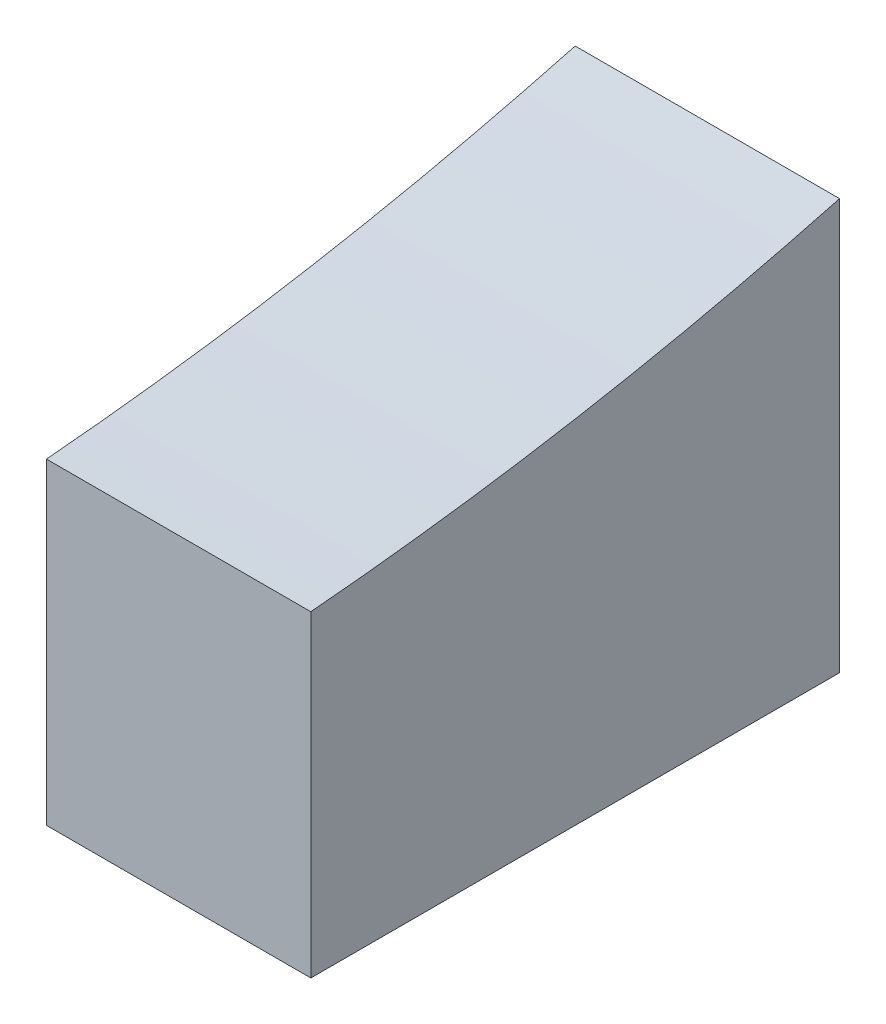
ISO-10303-21;
HEADER;
FILE_DESCRIPTION(('STEP AP214'),'2;1');
FILE_NAME('part.step','',(''),(''),'','','');
FILE_SCHEMA(('AUTOMOTIVE_DESIGN { 1 0 10303 214 1 1 1 1 }'));
ENDSEC;
DATA;
#1=APPLICATION_CONTEXT('core data for automotive mechanical design processes');
#2=APPLICATION_PROTOCOL_DEFINITION('international standard','automotive_design',2000,#1);
#3=PRODUCT_CONTEXT('',#1,'mechanical');
#4=PRODUCT('Part','Part','',(#3));
#5=PRODUCT_RELATED_PRODUCT_CATEGORY('part','',(#4));
#6=PRODUCT_DEFINITION_FORMATION('','',#4);
#7=PRODUCT_DEFINITION_CONTEXT('part definition',#1,'design');
#8=PRODUCT_DEFINITION('design','',#6,#7);
#9=PRODUCT_DEFINITION_SHAPE('','',#8);
#10=(LENGTH_UNIT() NAMED_UNIT(*) SI_UNIT(.MILLI.,.METRE.));
#11=(NAMED_UNIT(*) PLANE_ANGLE_UNIT() SI_UNIT($,.RADIAN.));
#12=(NAMED_UNIT(*) SI_UNIT($,.STERADIAN.) SOLID_ANGLE_UNIT());
#13=UNCERTAINTY_MEASURE_WITH_UNIT(LENGTH_MEASURE(1.E-05),#10,'distance_accuracy_value','');
#14=(GEOMETRIC_REPRESENTATION_CONTEXT(3) GLOBAL_UNCERTAINTY_ASSIGNED_CONTEXT((#13)) GLOBAL_UNIT_ASSIGNED_CONTEXT((#10,
#11,#12)) REPRESENTATION_CONTEXT('',''));
#15=CARTESIAN_POINT('',(0.,0.,0.));
#16=DIRECTION('',(0.,0.,1.));
#17=DIRECTION('',(1.,0.,0.));
#18=AXIS2_PLACEMENT_3D('',#15,#16,#17);
#19=CARTESIAN_POINT('',(10.,127.,0.));
#20=DIRECTION('',(-1.,0.,0.));
#21=DIRECTION('',(0.,0.,1.));
#22=AXIS2_PLACEMENT_3D('',#19,#20,#21);
#23=CYLINDRICAL_SURFACE('',#22,115.433963806152);
#24=CARTESIAN_POINT('',(0.,127.,0.));
#25=DIRECTION('',(-1.,0.,0.));
#26=DIRECTION('',(0.,0.,-1.));
#27=AXIS2_PLACEMENT_3D('',#24,#25,#26);
#28=CIRCLE('',#27,115.433963806152);
#29=CARTESIAN_POINT('',(0.,15.5325159519602,-30.));
#30=VERTEX_POINT('',#29);
#31=CARTESIAN_POINT('',(0.,12.,-10.));
#32=VERTEX_POINT('',#31);
#33=EDGE_CURVE('E98',#30,#32,#28,.T.);
#34=ORIENTED_EDGE('',*,*,#33,.T.);
#35=DIRECTION('',(-1.,0.,0.));
#36=VECTOR('',#35,1.);
#37=CARTESIAN_POINT('',(10.,12.,-10.));
#38=LINE('',#37,#36);
#39=CARTESIAN_POINT('',(10.,12.,-10.));
#40=VERTEX_POINT('',#39);
#41=EDGE_CURVE('E11',#40,#32,#38,.T.);
#42=ORIENTED_EDGE('',*,*,#41,.F.);
#43=CARTESIAN_POINT('',(10.,127.,0.));
#44=DIRECTION('',(-1.,0.,0.));
#45=DIRECTION('',(0.,0.,-1.));
#46=AXIS2_PLACEMENT_3D('',#43,#44,#45);
#47=CIRCLE('',#46,115.433963806152);
#48=CARTESIAN_POINT('',(10.,15.5325159519602,-30.));
#49=VERTEX_POINT('',#48);
#50=EDGE_CURVE('E86',#49,#40,#47,.T.);
#51=ORIENTED_EDGE('',*,*,#50,.F.);
#52=DIRECTION('',(-1.,0.,0.));
#53=VECTOR('',#52,1.);
#54=CARTESIAN_POINT('',(10.,15.5325159519602,-30.));
#55=LINE('',#54,#53);
#56=EDGE_CURVE('E94',#49,#30,#55,.T.);
#57=ORIENTED_EDGE('',*,*,#56,.T.);
#58=EDGE_LOOP('',(#34,#42,#51,#57));
#59=FACE_BOUND('',#58,.T.);
#60=ADVANCED_FACE('F35',(#59),#23,.F.);
#61=CARTESIAN_POINT('',(10.,12.,-10.));
#62=DIRECTION('',(0.,0.,-1.));
#63=DIRECTION('',(0.,1.,0.));
#64=AXIS2_PLACEMENT_3D('',#61,#62,#63);
#65=PLANE('',#64);
#66=DIRECTION('',(0.,-1.,0.));
#67=VECTOR('',#66,1.);
#68=CARTESIAN_POINT('',(0.,12.,-10.));
#69=LINE('',#68,#67);
#70=CARTESIAN_POINT('',(0.,0.,-10.));
#71=VERTEX_POINT('',#70);
#72=EDGE_CURVE('E90',#32,#71,#69,.T.);
#73=ORIENTED_EDGE('',*,*,#72,.T.);
#74=DIRECTION('',(-1.,0.,0.));
#75=VECTOR('',#74,1.);
#76=CARTESIAN_POINT('',(10.,0.,-10.));
#77=LINE('',#76,#75);
#78=CARTESIAN_POINT('',(10.,0.,-10.));
#79=VERTEX_POINT('',#78);
#80=EDGE_CURVE('E43',#79,#71,#77,.T.);
#81=ORIENTED_EDGE('',*,*,#80,.F.);
#82=DIRECTION('',(0.,-1.,0.));
#83=VECTOR('',#82,1.);
#84=CARTESIAN_POINT('',(10.,12.,-10.));
#85=LINE('',#84,#83);
#86=EDGE_CURVE('E81',#40,#79,#85,.T.);
#87=ORIENTED_EDGE('',*,*,#86,.F.);
#88=ORIENTED_EDGE('',*,*,#41,.T.);
#89=EDGE_LOOP('',(#73,#81,#87,#88));
#90=FACE_BOUND('',#89,.T.);
#91=ADVANCED_FACE('F89',(#90),#65,.F.);
#92=CARTESIAN_POINT('',(10.,0.,-10.));
#93=DIRECTION('',(0.,1.,0.));
#94=DIRECTION('',(0.,0.,1.));
#95=AXIS2_PLACEMENT_3D('',#92,#93,#94);
#96=PLANE('',#95);
#97=CARTESIAN_POINT('',(5.,0.,-18.));
#98=DIRECTION('',(0.,-1.,0.));
#99=DIRECTION('',(0.,0.,-1.));
#100=AXIS2_PLACEMENT_3D('',#97,#98,#99);
#101=CIRCLE('',#100,3.);
#102=CARTESIAN_POINT('',(5.,0.,-21.));
#103=VERTEX_POINT('',#102);
#104=EDGE_CURVE('E112',#103,#103,#101,.T.);
#105=ORIENTED_EDGE('',*,*,#104,.F.);
#106=EDGE_LOOP('',(#105));
#107=FACE_BOUND('',#106,.T.);
#108=DIRECTION('',(0.,0.,-1.));
#109=VECTOR('',#108,1.);
#110=CARTESIAN_POINT('',(0.,0.,-10.));
#111=LINE('',#110,#109);
#112=CARTESIAN_POINT('',(0.,0.,-30.));
#113=VERTEX_POINT('',#112);
#114=EDGE_CURVE('E68',#71,#113,#111,.T.);
#115=ORIENTED_EDGE('',*,*,#114,.T.);
#116=DIRECTION('',(-1.,0.,0.));
#117=VECTOR('',#116,1.);
#118=CARTESIAN_POINT('',(10.,0.,-30.));
#119=LINE('',#118,#117);
#120=CARTESIAN_POINT('',(10.,0.,-30.));
#121=VERTEX_POINT('',#120);
#122=EDGE_CURVE('E91',#121,#113,#119,.T.);
#123=ORIENTED_EDGE('',*,*,#122,.F.);
#124=DIRECTION('',(0.,0.,-1.));
#125=VECTOR('',#124,1.);
#126=CARTESIAN_POINT('',(10.,0.,-10.));
#127=LINE('',#126,#125);
#128=EDGE_CURVE('E84',#79,#121,#127,.T.);
#129=ORIENTED_EDGE('',*,*,#128,.F.);
#130=ORIENTED_EDGE('',*,*,#80,.T.);
#131=EDGE_LOOP('',(#115,#123,#129,#130));
#132=FACE_BOUND('',#131,.T.);
#133=ADVANCED_FACE('F92',(#107,#132),#96,.F.);
#134=CARTESIAN_POINT('',(10.,15.5325159519602,-30.));
#135=DIRECTION('',(0.,0.,1.));
#136=DIRECTION('',(0.,-1.,0.));
#137=AXIS2_PLACEMENT_3D('',#134,#135,#136);
#138=PLANE('',#137);
#139=DIRECTION('',(0.,1.,0.));
#140=VECTOR('',#139,1.);
#141=CARTESIAN_POINT('',(0.,15.5325159519602,-30.));
#142=LINE('',#141,#140);
#143=EDGE_CURVE('E74',#113,#30,#142,.T.);
#144=ORIENTED_EDGE('',*,*,#143,.T.);
#145=ORIENTED_EDGE('',*,*,#56,.F.);
#146=DIRECTION('',(0.,1.,0.));
#147=VECTOR('',#146,1.);
#148=CARTESIAN_POINT('',(10.,15.5325159519602,-30.));
#149=LINE('',#148,#147);
#150=EDGE_CURVE('E51',#121,#49,#149,.T.);
#151=ORIENTED_EDGE('',*,*,#150,.F.);
#152=ORIENTED_EDGE('',*,*,#122,.T.);
#153=EDGE_LOOP('',(#144,#145,#151,#152));
#154=FACE_BOUND('',#153,.T.);
#155=ADVANCED_FACE('F106',(#154),#138,.F.);
#156=CARTESIAN_POINT('',(10.,127.,0.));
#157=DIRECTION('',(1.,0.,0.));
#158=DIRECTION('',(0.,0.,-1.));
#159=AXIS2_PLACEMENT_3D('',#156,#157,#158);
#160=PLANE('',#159);
#161=ORIENTED_EDGE('',*,*,#50,.T.);
#162=ORIENTED_EDGE('',*,*,#86,.T.);
#163=ORIENTED_EDGE('',*,*,#128,.T.);
#164=ORIENTED_EDGE('',*,*,#150,.T.);
#165=EDGE_LOOP('',(#161,#162,#163,#164));
#166=FACE_BOUND('',#165,.T.);
#167=ADVANCED_FACE('F82',(#166),#160,.T.);
#168=CARTESIAN_POINT('',(0.,127.,0.));
#169=DIRECTION('',(1.,0.,0.));
#170=DIRECTION('',(0.,0.,-1.));
#171=AXIS2_PLACEMENT_3D('',#168,#169,#170);
#172=PLANE('',#171);
#173=ORIENTED_EDGE('',*,*,#33,.F.);
#174=ORIENTED_EDGE('',*,*,#143,.F.);
#175=ORIENTED_EDGE('',*,*,#114,.F.);
#176=ORIENTED_EDGE('',*,*,#72,.F.);
#177=EDGE_LOOP('',(#173,#174,#175,#176));
#178=FACE_BOUND('',#177,.T.);
#179=ADVANCED_FACE('F109',(#178),#172,.F.);
#180=CARTESIAN_POINT('',(5.,10.,-18.));
#181=DIRECTION('',(0.,-1.,0.));
#182=DIRECTION('',(0.,0.,-1.));
#183=AXIS2_PLACEMENT_3D('',#180,#181,#182);
#184=CYLINDRICAL_SURFACE('',#183,3.);
#185=CARTESIAN_POINT('',(5.,10.,-18.));
#186=DIRECTION('',(0.,-1.,0.));
#187=DIRECTION('',(0.,0.,-1.));
#188=AXIS2_PLACEMENT_3D('',#185,#186,#187);
#189=CIRCLE('',#188,3.);
#190=CARTESIAN_POINT('',(5.,10.,-21.));
#191=VERTEX_POINT('',#190);
#192=EDGE_CURVE('E101',#191,#191,#189,.T.);
#193=ORIENTED_EDGE('',*,*,#192,.F.);
#194=EDGE_LOOP('',(#193));
#195=FACE_BOUND('',#194,.T.);
#196=ORIENTED_EDGE('',*,*,#104,.T.);
#197=EDGE_LOOP('',(#196));
#198=FACE_BOUND('',#197,.T.);
#199=ADVANCED_FACE('F120',(#195,#198),#184,.F.);
#200=CARTESIAN_POINT('',(5.,10.,-18.));
#201=DIRECTION('',(0.,-1.,0.));
#202=DIRECTION('',(0.,0.,-1.));
#203=AXIS2_PLACEMENT_3D('',#200,#201,#202);
#204=PLANE('',#203);
#205=ORIENTED_EDGE('',*,*,#192,.T.);
#206=EDGE_LOOP('',(#205));
#207=FACE_BOUND('',#206,.T.);
#208=ADVANCED_FACE('F118',(#207),#204,.T.);
#209=CLOSED_SHELL('',(#60,#91,#133,#155,#167,#179,#199,#208));
#210=MANIFOLD_SOLID_BREP('B2',#209);
#211=ADVANCED_BREP_SHAPE_REPRESENTATION('',(#18,#210),#14);
#212=SHAPE_DEFINITION_REPRESENTATION(#9,#211);
ENDSEC;
END-ISO-10303-21;
